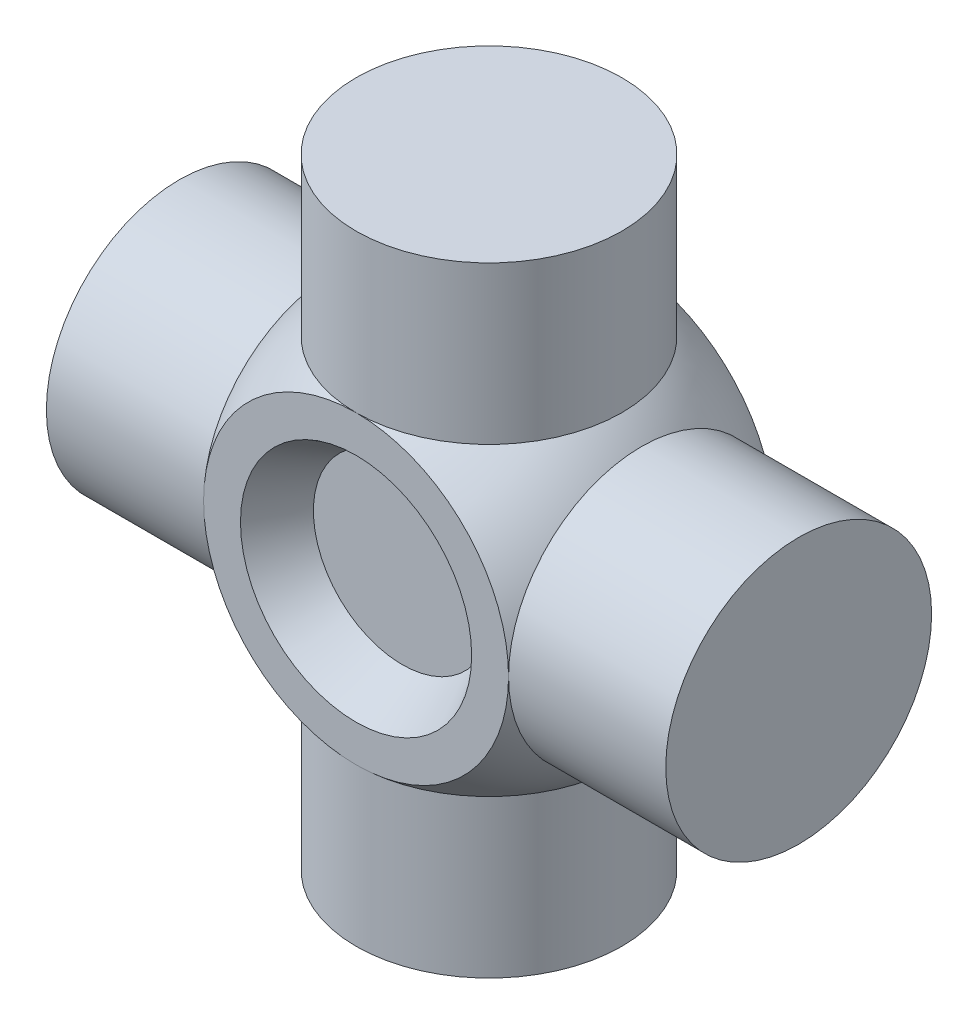
ISO-10303-21;
HEADER;
FILE_DESCRIPTION(('STEP AP214'),'2;1');
FILE_NAME('part.step','',(''),(''),'','','');
FILE_SCHEMA(('AUTOMOTIVE_DESIGN { 1 0 10303 214 1 1 1 1 }'));
ENDSEC;
DATA;
#1=APPLICATION_CONTEXT('core data for automotive mechanical design processes');
#2=APPLICATION_PROTOCOL_DEFINITION('international standard','automotive_design',2000,#1);
#3=PRODUCT_CONTEXT('',#1,'mechanical');
#4=PRODUCT('Part','Part','',(#3));
#5=PRODUCT_RELATED_PRODUCT_CATEGORY('part','',(#4));
#6=PRODUCT_DEFINITION_FORMATION('','',#4);
#7=PRODUCT_DEFINITION_CONTEXT('part definition',#1,'design');
#8=PRODUCT_DEFINITION('design','',#6,#7);
#9=PRODUCT_DEFINITION_SHAPE('','',#8);
#10=(LENGTH_UNIT() NAMED_UNIT(*) SI_UNIT(.MILLI.,.METRE.));
#11=(NAMED_UNIT(*) PLANE_ANGLE_UNIT() SI_UNIT($,.RADIAN.));
#12=(NAMED_UNIT(*) SI_UNIT($,.STERADIAN.) SOLID_ANGLE_UNIT());
#13=UNCERTAINTY_MEASURE_WITH_UNIT(LENGTH_MEASURE(1.E-05),#10,'distance_accuracy_value','');
#14=(GEOMETRIC_REPRESENTATION_CONTEXT(3) GLOBAL_UNCERTAINTY_ASSIGNED_CONTEXT((#13)) GLOBAL_UNIT_ASSIGNED_CONTEXT((#10,
#11,#12)) REPRESENTATION_CONTEXT('',''));
#15=CARTESIAN_POINT('',(0.,0.,0.));
#16=DIRECTION('',(0.,0.,1.));
#17=DIRECTION('',(1.,0.,0.));
#18=AXIS2_PLACEMENT_3D('',#15,#16,#17);
#19=CARTESIAN_POINT('',(-8.3762252835033,-10.287,-7.3025));
#20=DIRECTION('',(0.,0.,-1.));
#21=DIRECTION('',(-1.,0.,0.));
#22=AXIS2_PLACEMENT_3D('',#19,#20,#21);
#23=PLANE('',#22);
#24=CARTESIAN_POINT('',(0.,0.,-7.3025));
#25=DIRECTION('',(0.,0.,-1.));
#26=DIRECTION('',(-1.,0.,0.));
#27=AXIS2_PLACEMENT_3D('',#24,#25,#26);
#28=CIRCLE('',#27,8.37622528350331);
#29=CARTESIAN_POINT('',(8.3762252835033,0.,-7.3025));
#30=VERTEX_POINT('',#29);
#31=CARTESIAN_POINT('',(0.,8.3762252835033,-7.3025));
#32=VERTEX_POINT('',#31);
#33=EDGE_CURVE('E40',#30,#32,#28,.F.);
#34=ORIENTED_EDGE('',*,*,#33,.F.);
#35=CARTESIAN_POINT('',(0.,-8.3762252835033,-7.3025));
#36=VERTEX_POINT('',#35);
#37=EDGE_CURVE('E45',#36,#30,#28,.F.);
#38=ORIENTED_EDGE('',*,*,#37,.F.);
#39=CARTESIAN_POINT('',(-8.3762252835033,0.,-7.3025));
#40=VERTEX_POINT('',#39);
#41=EDGE_CURVE('E12',#40,#36,#28,.F.);
#42=ORIENTED_EDGE('',*,*,#41,.F.);
#43=EDGE_CURVE('E46',#32,#40,#28,.F.);
#44=ORIENTED_EDGE('',*,*,#43,.F.);
#45=EDGE_LOOP('',(#34,#38,#42,#44));
#46=FACE_BOUND('',#45,.T.);
#47=CARTESIAN_POINT('',(0.,0.,-7.3025));
#48=DIRECTION('',(0.,0.,1.));
#49=DIRECTION('',(1.,0.,0.));
#50=AXIS2_PLACEMENT_3D('',#47,#48,#49);
#51=CIRCLE('',#50,6.35);
#52=CARTESIAN_POINT('',(6.35,0.,-7.3025));
#53=VERTEX_POINT('',#52);
#54=EDGE_CURVE('E125',#53,#53,#51,.T.);
#55=ORIENTED_EDGE('',*,*,#54,.T.);
#56=EDGE_LOOP('',(#55));
#57=FACE_BOUND('',#56,.T.);
#58=ADVANCED_FACE('F36',(#46,#57),#23,.T.);
#59=CARTESIAN_POINT('',(0.,0.,0.));
#60=DIRECTION('',(0.,0.,1.));
#61=DIRECTION('',(-1.,0.,0.));
#62=AXIS2_PLACEMENT_3D('',#59,#60,#61);
#63=SPHERICAL_SURFACE('',#62,11.1125);
#64=CARTESIAN_POINT('',(0.,0.,7.3025));
#65=DIRECTION('',(0.,0.,1.));
#66=DIRECTION('',(1.,0.,0.));
#67=AXIS2_PLACEMENT_3D('',#64,#65,#66);
#68=CIRCLE('',#67,8.37622528350331);
#69=CARTESIAN_POINT('',(-8.3762252835033,0.,7.3025));
#70=VERTEX_POINT('',#69);
#71=CARTESIAN_POINT('',(0.,8.3762252835033,7.3025));
#72=VERTEX_POINT('',#71);
#73=EDGE_CURVE('E102',#70,#72,#68,.F.);
#74=ORIENTED_EDGE('',*,*,#73,.T.);
#75=CARTESIAN_POINT('',(0.,8.3762252835033,0.));
#76=DIRECTION('',(0.,1.,0.));
#77=DIRECTION('',(0.,0.,1.));
#78=AXIS2_PLACEMENT_3D('',#75,#76,#77);
#79=CIRCLE('',#78,7.3025);
#80=EDGE_CURVE('E52',#72,#32,#79,.F.);
#81=ORIENTED_EDGE('',*,*,#80,.T.);
#82=ORIENTED_EDGE('',*,*,#43,.T.);
#83=CARTESIAN_POINT('',(-8.3762252835033,0.,0.));
#84=DIRECTION('',(-1.,0.,0.));
#85=DIRECTION('',(0.,0.,1.));
#86=AXIS2_PLACEMENT_3D('',#83,#84,#85);
#87=CIRCLE('',#86,7.3025);
#88=EDGE_CURVE('E185',#40,#70,#87,.F.);
#89=ORIENTED_EDGE('',*,*,#88,.T.);
#90=EDGE_LOOP('',(#74,#81,#82,#89));
#91=FACE_BOUND('',#90,.T.);
#92=ADVANCED_FACE('F38',(#91),#63,.T.);
#93=ORIENTED_EDGE('',*,*,#33,.T.);
#94=EDGE_CURVE('E93',#32,#72,#79,.F.);
#95=ORIENTED_EDGE('',*,*,#94,.T.);
#96=CARTESIAN_POINT('',(8.3762252835033,0.,7.3025));
#97=VERTEX_POINT('',#96);
#98=EDGE_CURVE('E104',#72,#97,#68,.F.);
#99=ORIENTED_EDGE('',*,*,#98,.T.);
#100=CARTESIAN_POINT('',(8.3762252835033,0.,0.));
#101=DIRECTION('',(1.,0.,0.));
#102=DIRECTION('',(0.,0.,-1.));
#103=AXIS2_PLACEMENT_3D('',#100,#101,#102);
#104=CIRCLE('',#103,7.3025);
#105=EDGE_CURVE('E107',#97,#30,#104,.F.);
#106=ORIENTED_EDGE('',*,*,#105,.T.);
#107=EDGE_LOOP('',(#93,#95,#99,#106));
#108=FACE_BOUND('',#107,.T.);
#109=ADVANCED_FACE('F159',(#108),#63,.T.);
#110=ORIENTED_EDGE('',*,*,#41,.T.);
#111=CARTESIAN_POINT('',(0.,-8.3762252835033,0.));
#112=DIRECTION('',(0.,-1.,0.));
#113=DIRECTION('',(0.,0.,-1.));
#114=AXIS2_PLACEMENT_3D('',#111,#112,#113);
#115=CIRCLE('',#114,7.3025);
#116=CARTESIAN_POINT('',(0.,-8.3762252835033,7.3025));
#117=VERTEX_POINT('',#116);
#118=EDGE_CURVE('E59',#36,#117,#115,.F.);
#119=ORIENTED_EDGE('',*,*,#118,.T.);
#120=EDGE_CURVE('E90',#117,#70,#68,.F.);
#121=ORIENTED_EDGE('',*,*,#120,.T.);
#122=EDGE_CURVE('E184',#70,#40,#87,.F.);
#123=ORIENTED_EDGE('',*,*,#122,.T.);
#124=EDGE_LOOP('',(#110,#119,#121,#123));
#125=FACE_BOUND('',#124,.T.);
#126=ADVANCED_FACE('F88',(#125),#63,.T.);
#127=EDGE_CURVE('E99',#97,#117,#68,.F.);
#128=ORIENTED_EDGE('',*,*,#127,.T.);
#129=EDGE_CURVE('E76',#117,#36,#115,.F.);
#130=ORIENTED_EDGE('',*,*,#129,.T.);
#131=ORIENTED_EDGE('',*,*,#37,.T.);
#132=EDGE_CURVE('E106',#30,#97,#104,.F.);
#133=ORIENTED_EDGE('',*,*,#132,.T.);
#134=EDGE_LOOP('',(#128,#130,#131,#133));
#135=FACE_BOUND('',#134,.T.);
#136=ADVANCED_FACE('F105',(#135),#63,.T.);
#137=CARTESIAN_POINT('',(-8.3762252835033,-10.287,7.3025));
#138=DIRECTION('',(0.,0.,1.));
#139=DIRECTION('',(1.,0.,0.));
#140=AXIS2_PLACEMENT_3D('',#137,#138,#139);
#141=PLANE('',#140);
#142=CARTESIAN_POINT('',(0.,0.,7.3025));
#143=DIRECTION('',(0.,0.,1.));
#144=DIRECTION('',(1.,0.,0.));
#145=AXIS2_PLACEMENT_3D('',#142,#143,#144);
#146=CIRCLE('',#145,6.35);
#147=CARTESIAN_POINT('',(6.35,0.,7.3025));
#148=VERTEX_POINT('',#147);
#149=EDGE_CURVE('E119',#148,#148,#146,.T.);
#150=ORIENTED_EDGE('',*,*,#149,.F.);
#151=EDGE_LOOP('',(#150));
#152=FACE_BOUND('',#151,.T.);
#153=ORIENTED_EDGE('',*,*,#73,.F.);
#154=ORIENTED_EDGE('',*,*,#120,.F.);
#155=ORIENTED_EDGE('',*,*,#127,.F.);
#156=ORIENTED_EDGE('',*,*,#98,.F.);
#157=EDGE_LOOP('',(#153,#154,#155,#156));
#158=FACE_BOUND('',#157,.T.);
#159=ADVANCED_FACE('F97',(#152,#158),#141,.T.);
#160=CARTESIAN_POINT('',(0.,0.,7.3025));
#161=DIRECTION('',(0.,0.,1.));
#162=DIRECTION('',(1.,0.,0.));
#163=AXIS2_PLACEMENT_3D('',#160,#161,#162);
#164=CONICAL_SURFACE('',#163,6.35,0.5235987755983);
#165=CARTESIAN_POINT('',(0.,0.,4.7625));
#166=DIRECTION('',(0.,0.,1.));
#167=DIRECTION('',(1.,0.,0.));
#168=AXIS2_PLACEMENT_3D('',#165,#166,#167);
#169=CIRCLE('',#168,4.88353031625835);
#170=CARTESIAN_POINT('',(4.88353031625835,0.,4.7625));
#171=VERTEX_POINT('',#170);
#172=EDGE_CURVE('E83',#171,#171,#169,.T.);
#173=ORIENTED_EDGE('',*,*,#172,.F.);
#174=EDGE_LOOP('',(#173));
#175=FACE_BOUND('',#174,.T.);
#176=ORIENTED_EDGE('',*,*,#149,.T.);
#177=EDGE_LOOP('',(#176));
#178=FACE_BOUND('',#177,.T.);
#179=ADVANCED_FACE('F163',(#175,#178),#164,.F.);
#180=CARTESIAN_POINT('',(0.,0.,4.7625));
#181=DIRECTION('',(0.,0.,1.));
#182=DIRECTION('',(1.,0.,0.));
#183=AXIS2_PLACEMENT_3D('',#180,#181,#182);
#184=PLANE('',#183);
#185=ORIENTED_EDGE('',*,*,#172,.T.);
#186=EDGE_LOOP('',(#185));
#187=FACE_BOUND('',#186,.T.);
#188=ADVANCED_FACE('F171',(#187),#184,.T.);
#189=CARTESIAN_POINT('',(0.,0.,-7.3025));
#190=DIRECTION('',(0.,0.,-1.));
#191=DIRECTION('',(1.,0.,0.));
#192=AXIS2_PLACEMENT_3D('',#189,#190,#191);
#193=CONICAL_SURFACE('',#192,6.35,0.5235987755983);
#194=CARTESIAN_POINT('',(0.,0.,-4.7625));
#195=DIRECTION('',(0.,0.,-1.));
#196=DIRECTION('',(-1.,0.,0.));
#197=AXIS2_PLACEMENT_3D('',#194,#195,#196);
#198=CIRCLE('',#197,4.88353031625835);
#199=CARTESIAN_POINT('',(-4.88353031625835,0.,-4.7625));
#200=VERTEX_POINT('',#199);
#201=EDGE_CURVE('E122',#200,#200,#198,.F.);
#202=ORIENTED_EDGE('',*,*,#201,.T.);
#203=EDGE_LOOP('',(#202));
#204=FACE_BOUND('',#203,.T.);
#205=ORIENTED_EDGE('',*,*,#54,.F.);
#206=EDGE_LOOP('',(#205));
#207=FACE_BOUND('',#206,.T.);
#208=ADVANCED_FACE('F212',(#204,#207),#193,.F.);
#209=CARTESIAN_POINT('',(0.,0.,-4.7625));
#210=DIRECTION('',(0.,0.,-1.));
#211=DIRECTION('',(1.,0.,0.));
#212=AXIS2_PLACEMENT_3D('',#209,#210,#211);
#213=PLANE('',#212);
#214=ORIENTED_EDGE('',*,*,#201,.F.);
#215=EDGE_LOOP('',(#214));
#216=FACE_BOUND('',#215,.T.);
#217=ADVANCED_FACE('F208',(#216),#213,.T.);
#218=CARTESIAN_POINT('',(17.0122252835033,0.,0.));
#219=DIRECTION('',(-1.,0.,0.));
#220=DIRECTION('',(0.,0.,1.));
#221=AXIS2_PLACEMENT_3D('',#218,#219,#220);
#222=CYLINDRICAL_SURFACE('',#221,7.3025);
#223=ORIENTED_EDGE('',*,*,#105,.F.);
#224=ORIENTED_EDGE('',*,*,#132,.F.);
#225=EDGE_LOOP('',(#223,#224));
#226=FACE_BOUND('',#225,.T.);
#227=CARTESIAN_POINT('',(17.0122252835033,0.,0.));
#228=DIRECTION('',(1.,0.,0.));
#229=DIRECTION('',(0.,0.,-1.));
#230=AXIS2_PLACEMENT_3D('',#227,#228,#229);
#231=CIRCLE('',#230,7.3025);
#232=CARTESIAN_POINT('',(17.0122252835033,0.,-7.3025));
#233=VERTEX_POINT('',#232);
#234=EDGE_CURVE('E128',#233,#233,#231,.T.);
#235=ORIENTED_EDGE('',*,*,#234,.F.);
#236=EDGE_LOOP('',(#235));
#237=FACE_BOUND('',#236,.T.);
#238=ADVANCED_FACE('F204',(#226,#237),#222,.T.);
#239=CARTESIAN_POINT('',(17.0122252835033,0.,0.));
#240=DIRECTION('',(1.,0.,0.));
#241=DIRECTION('',(0.,0.,-1.));
#242=AXIS2_PLACEMENT_3D('',#239,#240,#241);
#243=PLANE('',#242);
#244=ORIENTED_EDGE('',*,*,#234,.T.);
#245=EDGE_LOOP('',(#244));
#246=FACE_BOUND('',#245,.T.);
#247=ADVANCED_FACE('F201',(#246),#243,.T.);
#248=CARTESIAN_POINT('',(0.,17.0122252835033,0.));
#249=DIRECTION('',(0.,-1.,0.));
#250=DIRECTION('',(0.,0.,-1.));
#251=AXIS2_PLACEMENT_3D('',#248,#249,#250);
#252=CYLINDRICAL_SURFACE('',#251,7.3025);
#253=ORIENTED_EDGE('',*,*,#94,.F.);
#254=ORIENTED_EDGE('',*,*,#80,.F.);
#255=EDGE_LOOP('',(#253,#254));
#256=FACE_BOUND('',#255,.T.);
#257=CARTESIAN_POINT('',(0.,17.0122252835033,0.));
#258=DIRECTION('',(0.,1.,0.));
#259=DIRECTION('',(0.,0.,1.));
#260=AXIS2_PLACEMENT_3D('',#257,#258,#259);
#261=CIRCLE('',#260,7.3025);
#262=CARTESIAN_POINT('',(0.,17.0122252835033,7.3025));
#263=VERTEX_POINT('',#262);
#264=EDGE_CURVE('E131',#263,#263,#261,.T.);
#265=ORIENTED_EDGE('',*,*,#264,.F.);
#266=EDGE_LOOP('',(#265));
#267=FACE_BOUND('',#266,.T.);
#268=ADVANCED_FACE('F195',(#256,#267),#252,.T.);
#269=CARTESIAN_POINT('',(0.,17.0122252835033,0.));
#270=DIRECTION('',(0.,1.,0.));
#271=DIRECTION('',(0.,0.,1.));
#272=AXIS2_PLACEMENT_3D('',#269,#270,#271);
#273=PLANE('',#272);
#274=ORIENTED_EDGE('',*,*,#264,.T.);
#275=EDGE_LOOP('',(#274));
#276=FACE_BOUND('',#275,.T.);
#277=ADVANCED_FACE('F189',(#276),#273,.T.);
#278=CARTESIAN_POINT('',(-17.0122252835033,0.,0.));
#279=DIRECTION('',(1.,0.,0.));
#280=DIRECTION('',(0.,0.,-1.));
#281=AXIS2_PLACEMENT_3D('',#278,#279,#280);
#282=CYLINDRICAL_SURFACE('',#281,7.3025);
#283=ORIENTED_EDGE('',*,*,#88,.F.);
#284=ORIENTED_EDGE('',*,*,#122,.F.);
#285=EDGE_LOOP('',(#283,#284));
#286=FACE_BOUND('',#285,.T.);
#287=CARTESIAN_POINT('',(-17.0122252835033,0.,0.));
#288=DIRECTION('',(-1.,0.,0.));
#289=DIRECTION('',(0.,0.,1.));
#290=AXIS2_PLACEMENT_3D('',#287,#288,#289);
#291=CIRCLE('',#290,7.3025);
#292=CARTESIAN_POINT('',(-17.0122252835033,0.,7.3025));
#293=VERTEX_POINT('',#292);
#294=EDGE_CURVE('E134',#293,#293,#291,.T.);
#295=ORIENTED_EDGE('',*,*,#294,.F.);
#296=EDGE_LOOP('',(#295));
#297=FACE_BOUND('',#296,.T.);
#298=ADVANCED_FACE('F150',(#286,#297),#282,.T.);
#299=CARTESIAN_POINT('',(-17.0122252835033,0.,0.));
#300=DIRECTION('',(-1.,0.,0.));
#301=DIRECTION('',(0.,0.,1.));
#302=AXIS2_PLACEMENT_3D('',#299,#300,#301);
#303=PLANE('',#302);
#304=ORIENTED_EDGE('',*,*,#294,.T.);
#305=EDGE_LOOP('',(#304));
#306=FACE_BOUND('',#305,.T.);
#307=ADVANCED_FACE('F143',(#306),#303,.T.);
#308=CARTESIAN_POINT('',(0.,-17.0122252835033,0.));
#309=DIRECTION('',(0.,1.,0.));
#310=DIRECTION('',(0.,0.,1.));
#311=AXIS2_PLACEMENT_3D('',#308,#309,#310);
#312=CYLINDRICAL_SURFACE('',#311,7.3025);
#313=ORIENTED_EDGE('',*,*,#129,.F.);
#314=ORIENTED_EDGE('',*,*,#118,.F.);
#315=EDGE_LOOP('',(#313,#314));
#316=FACE_BOUND('',#315,.T.);
#317=CARTESIAN_POINT('',(0.,-17.0122252835033,0.));
#318=DIRECTION('',(0.,-1.,0.));
#319=DIRECTION('',(0.,0.,-1.));
#320=AXIS2_PLACEMENT_3D('',#317,#318,#319);
#321=CIRCLE('',#320,7.3025);
#322=CARTESIAN_POINT('',(0.,-17.0122252835033,-7.3025));
#323=VERTEX_POINT('',#322);
#324=EDGE_CURVE('E137',#323,#323,#321,.T.);
#325=ORIENTED_EDGE('',*,*,#324,.F.);
#326=EDGE_LOOP('',(#325));
#327=FACE_BOUND('',#326,.T.);
#328=ADVANCED_FACE('F77',(#316,#327),#312,.T.);
#329=CARTESIAN_POINT('',(0.,-17.0122252835033,0.));
#330=DIRECTION('',(0.,-1.,0.));
#331=DIRECTION('',(0.,0.,-1.));
#332=AXIS2_PLACEMENT_3D('',#329,#330,#331);
#333=PLANE('',#332);
#334=ORIENTED_EDGE('',*,*,#324,.T.);
#335=EDGE_LOOP('',(#334));
#336=FACE_BOUND('',#335,.T.);
#337=ADVANCED_FACE('F141',(#336),#333,.T.);
#338=CLOSED_SHELL('',(#58,#92,#109,#126,#136,#159,#179,#188,#208,#217,#238,#247,#268,#277,#298,
#307,#328,#337));
#339=MANIFOLD_SOLID_BREP('B2',#338);
#340=ADVANCED_BREP_SHAPE_REPRESENTATION('',(#18,#339),#14);
#341=SHAPE_DEFINITION_REPRESENTATION(#9,#340);
ENDSEC;
END-ISO-10303-21;
